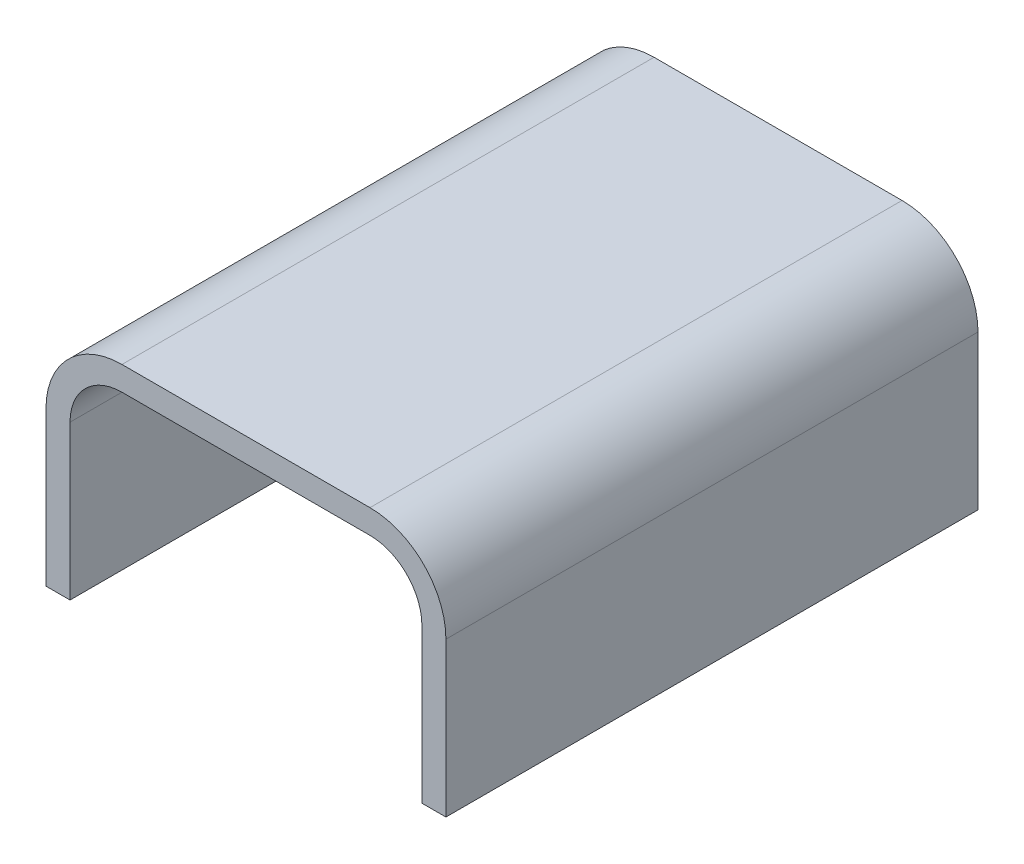
ISO-10303-21;
HEADER;
FILE_DESCRIPTION(('STEP AP214'),'2;1');
FILE_NAME('part.step','',(''),(''),'','','');
FILE_SCHEMA(('AUTOMOTIVE_DESIGN { 1 0 10303 214 1 1 1 1 }'));
ENDSEC;
DATA;
#1=APPLICATION_CONTEXT('core data for automotive mechanical design processes');
#2=APPLICATION_PROTOCOL_DEFINITION('international standard','automotive_design',2000,#1);
#3=PRODUCT_CONTEXT('',#1,'mechanical');
#4=PRODUCT('Part','Part','',(#3));
#5=PRODUCT_RELATED_PRODUCT_CATEGORY('part','',(#4));
#6=PRODUCT_DEFINITION_FORMATION('','',#4);
#7=PRODUCT_DEFINITION_CONTEXT('part definition',#1,'design');
#8=PRODUCT_DEFINITION('design','',#6,#7);
#9=PRODUCT_DEFINITION_SHAPE('','',#8);
#10=(LENGTH_UNIT() NAMED_UNIT(*) SI_UNIT(.MILLI.,.METRE.));
#11=(NAMED_UNIT(*) PLANE_ANGLE_UNIT() SI_UNIT($,.RADIAN.));
#12=(NAMED_UNIT(*) SI_UNIT($,.STERADIAN.) SOLID_ANGLE_UNIT());
#13=UNCERTAINTY_MEASURE_WITH_UNIT(LENGTH_MEASURE(1.E-05),#10,'distance_accuracy_value','');
#14=(GEOMETRIC_REPRESENTATION_CONTEXT(3) GLOBAL_UNCERTAINTY_ASSIGNED_CONTEXT((#13)) GLOBAL_UNIT_ASSIGNED_CONTEXT((#10,
#11,#12)) REPRESENTATION_CONTEXT('',''));
#15=CARTESIAN_POINT('',(0.,0.,0.));
#16=DIRECTION('',(0.,0.,1.));
#17=DIRECTION('',(1.,0.,0.));
#18=AXIS2_PLACEMENT_3D('',#15,#16,#17);
#19=CARTESIAN_POINT('',(-1.4,0.,31.));
#20=DIRECTION('',(0.,1.,0.));
#21=DIRECTION('',(0.,0.,1.));
#22=AXIS2_PLACEMENT_3D('',#19,#20,#21);
#23=PLANE('',#22);
#24=DIRECTION('',(1.,0.,0.));
#25=VECTOR('',#24,1.);
#26=CARTESIAN_POINT('',(-1.4,0.,0.));
#27=LINE('',#26,#25);
#28=CARTESIAN_POINT('',(-1.4,0.,0.));
#29=VERTEX_POINT('',#28);
#30=CARTESIAN_POINT('',(0.,0.,0.));
#31=VERTEX_POINT('',#30);
#32=EDGE_CURVE('E155',#29,#31,#27,.T.);
#33=ORIENTED_EDGE('',*,*,#32,.T.);
#34=DIRECTION('',(0.,0.,-1.));
#35=VECTOR('',#34,1.);
#36=CARTESIAN_POINT('',(0.,0.,31.));
#37=LINE('',#36,#35);
#38=CARTESIAN_POINT('',(0.,0.,31.));
#39=VERTEX_POINT('',#38);
#40=EDGE_CURVE('E11',#39,#31,#37,.T.);
#41=ORIENTED_EDGE('',*,*,#40,.F.);
#42=DIRECTION('',(1.,0.,0.));
#43=VECTOR('',#42,1.);
#44=CARTESIAN_POINT('',(-1.4,0.,31.));
#45=LINE('',#44,#43);
#46=CARTESIAN_POINT('',(-1.4,0.,31.));
#47=VERTEX_POINT('',#46);
#48=EDGE_CURVE('E177',#47,#39,#45,.T.);
#49=ORIENTED_EDGE('',*,*,#48,.F.);
#50=DIRECTION('',(0.,0.,-1.));
#51=VECTOR('',#50,1.);
#52=CARTESIAN_POINT('',(-1.4,0.,31.));
#53=LINE('',#52,#51);
#54=EDGE_CURVE('E151',#47,#29,#53,.T.);
#55=ORIENTED_EDGE('',*,*,#54,.T.);
#56=EDGE_LOOP('',(#33,#41,#49,#55));
#57=FACE_BOUND('',#56,.T.);
#58=ADVANCED_FACE('F35',(#57),#23,.F.);
#59=CARTESIAN_POINT('',(0.,0.,31.));
#60=DIRECTION('',(-1.,0.,0.));
#61=DIRECTION('',(0.,0.,1.));
#62=AXIS2_PLACEMENT_3D('',#59,#60,#61);
#63=PLANE('',#62);
#64=DIRECTION('',(0.,1.,0.));
#65=VECTOR('',#64,1.);
#66=CARTESIAN_POINT('',(0.,0.,0.));
#67=LINE('',#66,#65);
#68=CARTESIAN_POINT('',(0.,8.975,0.));
#69=VERTEX_POINT('',#68);
#70=EDGE_CURVE('E158',#31,#69,#67,.T.);
#71=ORIENTED_EDGE('',*,*,#70,.T.);
#72=DIRECTION('',(0.,0.,-1.));
#73=VECTOR('',#72,1.);
#74=CARTESIAN_POINT('',(0.,8.975,31.));
#75=LINE('',#74,#73);
#76=CARTESIAN_POINT('',(0.,8.975,31.));
#77=VERTEX_POINT('',#76);
#78=EDGE_CURVE('E43',#77,#69,#75,.T.);
#79=ORIENTED_EDGE('',*,*,#78,.F.);
#80=DIRECTION('',(0.,1.,0.));
#81=VECTOR('',#80,1.);
#82=CARTESIAN_POINT('',(0.,0.,31.));
#83=LINE('',#82,#81);
#84=EDGE_CURVE('E106',#39,#77,#83,.T.);
#85=ORIENTED_EDGE('',*,*,#84,.F.);
#86=ORIENTED_EDGE('',*,*,#40,.T.);
#87=EDGE_LOOP('',(#71,#79,#85,#86));
#88=FACE_BOUND('',#87,.T.);
#89=ADVANCED_FACE('F255',(#88),#63,.F.);
#90=CARTESIAN_POINT('',(3.025,8.975,31.));
#91=DIRECTION('',(0.,0.,-1.));
#92=DIRECTION('',(-1.,0.,0.));
#93=AXIS2_PLACEMENT_3D('',#90,#91,#92);
#94=CYLINDRICAL_SURFACE('',#93,3.025);
#95=CARTESIAN_POINT('',(3.025,8.975,0.));
#96=DIRECTION('',(0.,0.,-1.));
#97=DIRECTION('',(1.,0.,0.));
#98=AXIS2_PLACEMENT_3D('',#95,#96,#97);
#99=CIRCLE('',#98,3.025);
#100=CARTESIAN_POINT('',(3.025,12.,0.));
#101=VERTEX_POINT('',#100);
#102=EDGE_CURVE('E160',#69,#101,#99,.T.);
#103=ORIENTED_EDGE('',*,*,#102,.T.);
#104=DIRECTION('',(0.,0.,-1.));
#105=VECTOR('',#104,1.);
#106=CARTESIAN_POINT('',(3.025,12.,31.));
#107=LINE('',#106,#105);
#108=CARTESIAN_POINT('',(3.025,12.,31.));
#109=VERTEX_POINT('',#108);
#110=EDGE_CURVE('E196',#109,#101,#107,.T.);
#111=ORIENTED_EDGE('',*,*,#110,.F.);
#112=CARTESIAN_POINT('',(3.025,8.975,31.));
#113=DIRECTION('',(0.,0.,-1.));
#114=DIRECTION('',(1.,0.,0.));
#115=AXIS2_PLACEMENT_3D('',#112,#113,#114);
#116=CIRCLE('',#115,3.025);
#117=EDGE_CURVE('E204',#77,#109,#116,.T.);
#118=ORIENTED_EDGE('',*,*,#117,.F.);
#119=ORIENTED_EDGE('',*,*,#78,.T.);
#120=EDGE_LOOP('',(#103,#111,#118,#119));
#121=FACE_BOUND('',#120,.T.);
#122=ADVANCED_FACE('F202',(#121),#94,.F.);
#123=CARTESIAN_POINT('',(3.025,12.,31.));
#124=DIRECTION('',(0.,1.,0.));
#125=DIRECTION('',(0.,0.,1.));
#126=AXIS2_PLACEMENT_3D('',#123,#124,#125);
#127=PLANE('',#126);
#128=DIRECTION('',(1.,0.,0.));
#129=VECTOR('',#128,1.);
#130=CARTESIAN_POINT('',(3.025,12.,0.));
#131=LINE('',#130,#129);
#132=CARTESIAN_POINT('',(17.475,12.,0.));
#133=VERTEX_POINT('',#132);
#134=EDGE_CURVE('E162',#101,#133,#131,.T.);
#135=ORIENTED_EDGE('',*,*,#134,.T.);
#136=DIRECTION('',(0.,0.,-1.));
#137=VECTOR('',#136,1.);
#138=CARTESIAN_POINT('',(17.475,12.,31.));
#139=LINE('',#138,#137);
#140=CARTESIAN_POINT('',(17.475,12.,31.));
#141=VERTEX_POINT('',#140);
#142=EDGE_CURVE('E193',#141,#133,#139,.T.);
#143=ORIENTED_EDGE('',*,*,#142,.F.);
#144=DIRECTION('',(1.,0.,0.));
#145=VECTOR('',#144,1.);
#146=CARTESIAN_POINT('',(3.025,12.,31.));
#147=LINE('',#146,#145);
#148=EDGE_CURVE('E222',#109,#141,#147,.T.);
#149=ORIENTED_EDGE('',*,*,#148,.F.);
#150=ORIENTED_EDGE('',*,*,#110,.T.);
#151=EDGE_LOOP('',(#135,#143,#149,#150));
#152=FACE_BOUND('',#151,.T.);
#153=ADVANCED_FACE('F213',(#152),#127,.F.);
#154=CARTESIAN_POINT('',(17.475,8.975,31.));
#155=DIRECTION('',(0.,0.,-1.));
#156=DIRECTION('',(-1.,0.,0.));
#157=AXIS2_PLACEMENT_3D('',#154,#155,#156);
#158=CYLINDRICAL_SURFACE('',#157,3.025);
#159=CARTESIAN_POINT('',(17.475,8.975,0.));
#160=DIRECTION('',(0.,0.,-1.));
#161=DIRECTION('',(1.,0.,0.));
#162=AXIS2_PLACEMENT_3D('',#159,#160,#161);
#163=CIRCLE('',#162,3.025);
#164=CARTESIAN_POINT('',(20.5,8.975,0.));
#165=VERTEX_POINT('',#164);
#166=EDGE_CURVE('E164',#133,#165,#163,.T.);
#167=ORIENTED_EDGE('',*,*,#166,.T.);
#168=DIRECTION('',(0.,0.,-1.));
#169=VECTOR('',#168,1.);
#170=CARTESIAN_POINT('',(20.5,8.975,31.));
#171=LINE('',#170,#169);
#172=CARTESIAN_POINT('',(20.5,8.975,31.));
#173=VERTEX_POINT('',#172);
#174=EDGE_CURVE('E190',#173,#165,#171,.T.);
#175=ORIENTED_EDGE('',*,*,#174,.F.);
#176=CARTESIAN_POINT('',(17.475,8.975,31.));
#177=DIRECTION('',(0.,0.,-1.));
#178=DIRECTION('',(1.,0.,0.));
#179=AXIS2_PLACEMENT_3D('',#176,#177,#178);
#180=CIRCLE('',#179,3.025);
#181=EDGE_CURVE('E219',#141,#173,#180,.T.);
#182=ORIENTED_EDGE('',*,*,#181,.F.);
#183=ORIENTED_EDGE('',*,*,#142,.T.);
#184=EDGE_LOOP('',(#167,#175,#182,#183));
#185=FACE_BOUND('',#184,.T.);
#186=ADVANCED_FACE('F217',(#185),#158,.F.);
#187=CARTESIAN_POINT('',(20.5,8.975,31.));
#188=DIRECTION('',(1.,0.,0.));
#189=DIRECTION('',(0.,0.,-1.));
#190=AXIS2_PLACEMENT_3D('',#187,#188,#189);
#191=PLANE('',#190);
#192=DIRECTION('',(0.,-1.,0.));
#193=VECTOR('',#192,1.);
#194=CARTESIAN_POINT('',(20.5,8.975,0.));
#195=LINE('',#194,#193);
#196=CARTESIAN_POINT('',(20.5,0.,0.));
#197=VERTEX_POINT('',#196);
#198=EDGE_CURVE('E166',#165,#197,#195,.T.);
#199=ORIENTED_EDGE('',*,*,#198,.T.);
#200=DIRECTION('',(0.,0.,-1.));
#201=VECTOR('',#200,1.);
#202=CARTESIAN_POINT('',(20.5,0.,31.));
#203=LINE('',#202,#201);
#204=CARTESIAN_POINT('',(20.5,0.,31.));
#205=VERTEX_POINT('',#204);
#206=EDGE_CURVE('E187',#205,#197,#203,.T.);
#207=ORIENTED_EDGE('',*,*,#206,.F.);
#208=DIRECTION('',(0.,-1.,0.));
#209=VECTOR('',#208,1.);
#210=CARTESIAN_POINT('',(20.5,8.975,31.));
#211=LINE('',#210,#209);
#212=EDGE_CURVE('E221',#173,#205,#211,.T.);
#213=ORIENTED_EDGE('',*,*,#212,.F.);
#214=ORIENTED_EDGE('',*,*,#174,.T.);
#215=EDGE_LOOP('',(#199,#207,#213,#214));
#216=FACE_BOUND('',#215,.T.);
#217=ADVANCED_FACE('F268',(#216),#191,.F.);
#218=CARTESIAN_POINT('',(20.5,0.,31.));
#219=DIRECTION('',(0.,1.,0.));
#220=DIRECTION('',(-1.,0.,0.));
#221=AXIS2_PLACEMENT_3D('',#218,#219,#220);
#222=PLANE('',#221);
#223=DIRECTION('',(1.,0.,0.));
#224=VECTOR('',#223,1.);
#225=CARTESIAN_POINT('',(20.5,0.,0.));
#226=LINE('',#225,#224);
#227=CARTESIAN_POINT('',(21.9,0.,0.));
#228=VERTEX_POINT('',#227);
#229=EDGE_CURVE('E168',#197,#228,#226,.T.);
#230=ORIENTED_EDGE('',*,*,#229,.T.);
#231=DIRECTION('',(0.,0.,-1.));
#232=VECTOR('',#231,1.);
#233=CARTESIAN_POINT('',(21.9,0.,31.));
#234=LINE('',#233,#232);
#235=CARTESIAN_POINT('',(21.9,0.,31.));
#236=VERTEX_POINT('',#235);
#237=EDGE_CURVE('E184',#236,#228,#234,.T.);
#238=ORIENTED_EDGE('',*,*,#237,.F.);
#239=DIRECTION('',(1.,0.,0.));
#240=VECTOR('',#239,1.);
#241=CARTESIAN_POINT('',(20.5,0.,31.));
#242=LINE('',#241,#240);
#243=EDGE_CURVE('E224',#205,#236,#242,.T.);
#244=ORIENTED_EDGE('',*,*,#243,.F.);
#245=ORIENTED_EDGE('',*,*,#206,.T.);
#246=EDGE_LOOP('',(#230,#238,#244,#245));
#247=FACE_BOUND('',#246,.T.);
#248=ADVANCED_FACE('F271',(#247),#222,.F.);
#249=CARTESIAN_POINT('',(21.9,8.975,31.));
#250=DIRECTION('',(-1.,0.,0.));
#251=DIRECTION('',(0.,0.,1.));
#252=AXIS2_PLACEMENT_3D('',#249,#250,#251);
#253=PLANE('',#252);
#254=DIRECTION('',(0.,1.,0.));
#255=VECTOR('',#254,1.);
#256=CARTESIAN_POINT('',(21.9,8.975,0.));
#257=LINE('',#256,#255);
#258=CARTESIAN_POINT('',(21.9,8.975,0.));
#259=VERTEX_POINT('',#258);
#260=EDGE_CURVE('E170',#228,#259,#257,.T.);
#261=ORIENTED_EDGE('',*,*,#260,.T.);
#262=DIRECTION('',(0.,0.,-1.));
#263=VECTOR('',#262,1.);
#264=CARTESIAN_POINT('',(21.9,8.975,31.));
#265=LINE('',#264,#263);
#266=CARTESIAN_POINT('',(21.9,8.975,31.));
#267=VERTEX_POINT('',#266);
#268=EDGE_CURVE('E181',#267,#259,#265,.T.);
#269=ORIENTED_EDGE('',*,*,#268,.F.);
#270=DIRECTION('',(0.,1.,0.));
#271=VECTOR('',#270,1.);
#272=CARTESIAN_POINT('',(21.9,8.975,31.));
#273=LINE('',#272,#271);
#274=EDGE_CURVE('E230',#236,#267,#273,.T.);
#275=ORIENTED_EDGE('',*,*,#274,.F.);
#276=ORIENTED_EDGE('',*,*,#237,.T.);
#277=EDGE_LOOP('',(#261,#269,#275,#276));
#278=FACE_BOUND('',#277,.T.);
#279=ADVANCED_FACE('F236',(#278),#253,.F.);
#280=CARTESIAN_POINT('',(17.475,8.975,31.));
#281=DIRECTION('',(0.,0.,-1.));
#282=DIRECTION('',(-1.,0.,0.));
#283=AXIS2_PLACEMENT_3D('',#280,#281,#282);
#284=CYLINDRICAL_SURFACE('',#283,4.425);
#285=CARTESIAN_POINT('',(17.475,8.975,0.));
#286=DIRECTION('',(0.,0.,1.));
#287=DIRECTION('',(1.,0.,0.));
#288=AXIS2_PLACEMENT_3D('',#285,#286,#287);
#289=CIRCLE('',#288,4.425);
#290=CARTESIAN_POINT('',(17.475,13.4,0.));
#291=VERTEX_POINT('',#290);
#292=EDGE_CURVE('E172',#259,#291,#289,.T.);
#293=ORIENTED_EDGE('',*,*,#292,.T.);
#294=DIRECTION('',(0.,0.,-1.));
#295=VECTOR('',#294,1.);
#296=CARTESIAN_POINT('',(17.475,13.4,31.));
#297=LINE('',#296,#295);
#298=CARTESIAN_POINT('',(17.475,13.4,31.));
#299=VERTEX_POINT('',#298);
#300=EDGE_CURVE('E146',#299,#291,#297,.T.);
#301=ORIENTED_EDGE('',*,*,#300,.F.);
#302=CARTESIAN_POINT('',(17.475,8.975,31.));
#303=DIRECTION('',(0.,0.,1.));
#304=DIRECTION('',(1.,0.,0.));
#305=AXIS2_PLACEMENT_3D('',#302,#303,#304);
#306=CIRCLE('',#305,4.425);
#307=EDGE_CURVE('E137',#267,#299,#306,.T.);
#308=ORIENTED_EDGE('',*,*,#307,.F.);
#309=ORIENTED_EDGE('',*,*,#268,.T.);
#310=EDGE_LOOP('',(#293,#301,#308,#309));
#311=FACE_BOUND('',#310,.T.);
#312=ADVANCED_FACE('F240',(#311),#284,.T.);
#313=CARTESIAN_POINT('',(3.025,13.4,31.));
#314=DIRECTION('',(0.,-1.,0.));
#315=DIRECTION('',(0.,0.,-1.));
#316=AXIS2_PLACEMENT_3D('',#313,#314,#315);
#317=PLANE('',#316);
#318=DIRECTION('',(-1.,0.,0.));
#319=VECTOR('',#318,1.);
#320=CARTESIAN_POINT('',(3.025,13.4,0.));
#321=LINE('',#320,#319);
#322=CARTESIAN_POINT('',(3.025,13.4,0.));
#323=VERTEX_POINT('',#322);
#324=EDGE_CURVE('E145',#291,#323,#321,.T.);
#325=ORIENTED_EDGE('',*,*,#324,.T.);
#326=DIRECTION('',(0.,0.,-1.));
#327=VECTOR('',#326,1.);
#328=CARTESIAN_POINT('',(3.025,13.4,31.));
#329=LINE('',#328,#327);
#330=CARTESIAN_POINT('',(3.025,13.4,31.));
#331=VERTEX_POINT('',#330);
#332=EDGE_CURVE('E142',#331,#323,#329,.T.);
#333=ORIENTED_EDGE('',*,*,#332,.F.);
#334=DIRECTION('',(-1.,0.,0.));
#335=VECTOR('',#334,1.);
#336=CARTESIAN_POINT('',(3.025,13.4,31.));
#337=LINE('',#336,#335);
#338=EDGE_CURVE('E131',#299,#331,#337,.T.);
#339=ORIENTED_EDGE('',*,*,#338,.F.);
#340=ORIENTED_EDGE('',*,*,#300,.T.);
#341=EDGE_LOOP('',(#325,#333,#339,#340));
#342=FACE_BOUND('',#341,.T.);
#343=ADVANCED_FACE('F143',(#342),#317,.F.);
#344=CARTESIAN_POINT('',(3.025,8.975,31.));
#345=DIRECTION('',(0.,0.,-1.));
#346=DIRECTION('',(-1.,0.,0.));
#347=AXIS2_PLACEMENT_3D('',#344,#345,#346);
#348=CYLINDRICAL_SURFACE('',#347,4.425);
#349=CARTESIAN_POINT('',(3.025,8.975,0.));
#350=DIRECTION('',(0.,0.,1.));
#351=DIRECTION('',(1.,0.,0.));
#352=AXIS2_PLACEMENT_3D('',#349,#350,#351);
#353=CIRCLE('',#352,4.425);
#354=CARTESIAN_POINT('',(-1.4,8.975,0.));
#355=VERTEX_POINT('',#354);
#356=EDGE_CURVE('E92',#323,#355,#353,.T.);
#357=ORIENTED_EDGE('',*,*,#356,.T.);
#358=DIRECTION('',(0.,0.,-1.));
#359=VECTOR('',#358,1.);
#360=CARTESIAN_POINT('',(-1.4,8.975,31.));
#361=LINE('',#360,#359);
#362=CARTESIAN_POINT('',(-1.4,8.975,31.));
#363=VERTEX_POINT('',#362);
#364=EDGE_CURVE('E147',#363,#355,#361,.T.);
#365=ORIENTED_EDGE('',*,*,#364,.F.);
#366=CARTESIAN_POINT('',(3.025,8.975,31.));
#367=DIRECTION('',(0.,0.,1.));
#368=DIRECTION('',(1.,0.,0.));
#369=AXIS2_PLACEMENT_3D('',#366,#367,#368);
#370=CIRCLE('',#369,4.425);
#371=EDGE_CURVE('E135',#331,#363,#370,.T.);
#372=ORIENTED_EDGE('',*,*,#371,.F.);
#373=ORIENTED_EDGE('',*,*,#332,.T.);
#374=EDGE_LOOP('',(#357,#365,#372,#373));
#375=FACE_BOUND('',#374,.T.);
#376=ADVANCED_FACE('F149',(#375),#348,.T.);
#377=CARTESIAN_POINT('',(-1.4,0.,31.));
#378=DIRECTION('',(1.,0.,0.));
#379=DIRECTION('',(0.,0.,-1.));
#380=AXIS2_PLACEMENT_3D('',#377,#378,#379);
#381=PLANE('',#380);
#382=DIRECTION('',(0.,-1.,0.));
#383=VECTOR('',#382,1.);
#384=CARTESIAN_POINT('',(-1.4,0.,0.));
#385=LINE('',#384,#383);
#386=EDGE_CURVE('E98',#355,#29,#385,.T.);
#387=ORIENTED_EDGE('',*,*,#386,.T.);
#388=ORIENTED_EDGE('',*,*,#54,.F.);
#389=DIRECTION('',(0.,-1.,0.));
#390=VECTOR('',#389,1.);
#391=CARTESIAN_POINT('',(-1.4,0.,31.));
#392=LINE('',#391,#390);
#393=EDGE_CURVE('E51',#363,#47,#392,.T.);
#394=ORIENTED_EDGE('',*,*,#393,.F.);
#395=ORIENTED_EDGE('',*,*,#364,.T.);
#396=EDGE_LOOP('',(#387,#388,#394,#395));
#397=FACE_BOUND('',#396,.T.);
#398=ADVANCED_FACE('F244',(#397),#381,.F.);
#399=CARTESIAN_POINT('',(3.025,8.975,31.));
#400=DIRECTION('',(0.,0.,1.));
#401=DIRECTION('',(1.,0.,0.));
#402=AXIS2_PLACEMENT_3D('',#399,#400,#401);
#403=PLANE('',#402);
#404=ORIENTED_EDGE('',*,*,#48,.T.);
#405=ORIENTED_EDGE('',*,*,#84,.T.);
#406=ORIENTED_EDGE('',*,*,#117,.T.);
#407=ORIENTED_EDGE('',*,*,#148,.T.);
#408=ORIENTED_EDGE('',*,*,#181,.T.);
#409=ORIENTED_EDGE('',*,*,#212,.T.);
#410=ORIENTED_EDGE('',*,*,#243,.T.);
#411=ORIENTED_EDGE('',*,*,#274,.T.);
#412=ORIENTED_EDGE('',*,*,#307,.T.);
#413=ORIENTED_EDGE('',*,*,#338,.T.);
#414=ORIENTED_EDGE('',*,*,#371,.T.);
#415=ORIENTED_EDGE('',*,*,#393,.T.);
#416=EDGE_LOOP('',(#404,#405,#406,#407,#408,#409,#410,#411,#412,#413,#414,#415));
#417=FACE_BOUND('',#416,.T.);
#418=ADVANCED_FACE('F133',(#417),#403,.T.);
#419=CARTESIAN_POINT('',(3.025,8.975,0.));
#420=DIRECTION('',(0.,0.,1.));
#421=DIRECTION('',(1.,0.,0.));
#422=AXIS2_PLACEMENT_3D('',#419,#420,#421);
#423=PLANE('',#422);
#424=ORIENTED_EDGE('',*,*,#32,.F.);
#425=ORIENTED_EDGE('',*,*,#386,.F.);
#426=ORIENTED_EDGE('',*,*,#356,.F.);
#427=ORIENTED_EDGE('',*,*,#324,.F.);
#428=ORIENTED_EDGE('',*,*,#292,.F.);
#429=ORIENTED_EDGE('',*,*,#260,.F.);
#430=ORIENTED_EDGE('',*,*,#229,.F.);
#431=ORIENTED_EDGE('',*,*,#198,.F.);
#432=ORIENTED_EDGE('',*,*,#166,.F.);
#433=ORIENTED_EDGE('',*,*,#134,.F.);
#434=ORIENTED_EDGE('',*,*,#102,.F.);
#435=ORIENTED_EDGE('',*,*,#70,.F.);
#436=EDGE_LOOP('',(#424,#425,#426,#427,#428,#429,#430,#431,#432,#433,#434,#435));
#437=FACE_BOUND('',#436,.T.);
#438=ADVANCED_FACE('F208',(#437),#423,.F.);
#439=CLOSED_SHELL('',(#58,#89,#122,#153,#186,#217,#248,#279,#312,#343,#376,#398,#418,#438));
#440=MANIFOLD_SOLID_BREP('B2',#439);
#441=ADVANCED_BREP_SHAPE_REPRESENTATION('',(#18,#440),#14);
#442=SHAPE_DEFINITION_REPRESENTATION(#9,#441);
ENDSEC;
END-ISO-10303-21;
